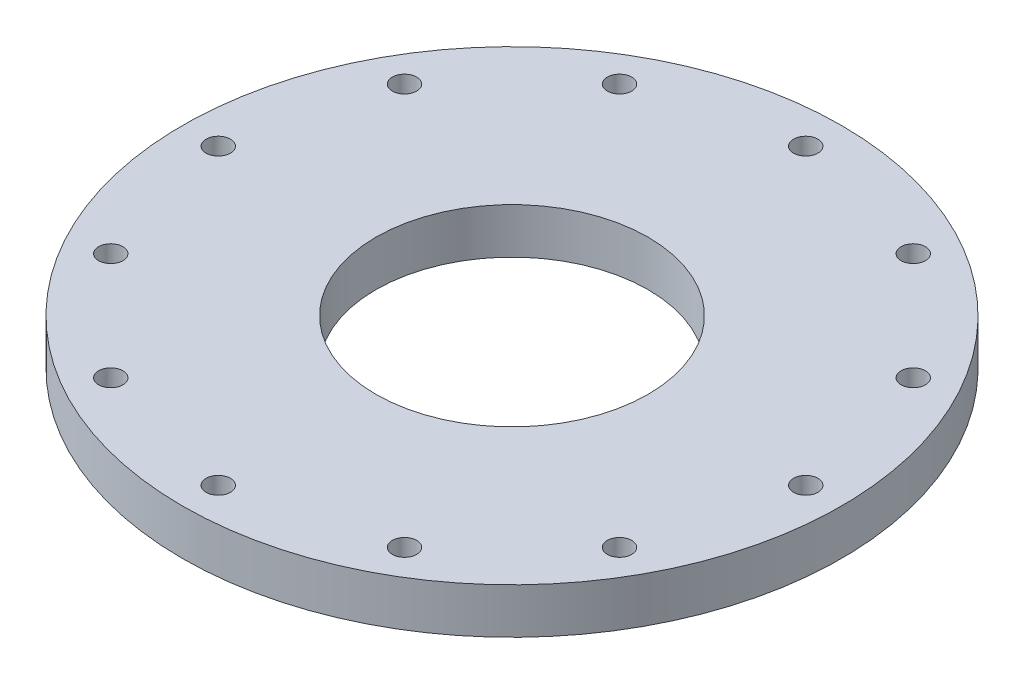
ISO-10303-21;
HEADER;
FILE_DESCRIPTION(('STEP AP214'),'2;1');
FILE_NAME('part.step','',(''),(''),'','','');
FILE_SCHEMA(('AUTOMOTIVE_DESIGN { 1 0 10303 214 1 1 1 1 }'));
ENDSEC;
DATA;
#1=APPLICATION_CONTEXT('core data for automotive mechanical design processes');
#2=APPLICATION_PROTOCOL_DEFINITION('international standard','automotive_design',2000,#1);
#3=PRODUCT_CONTEXT('',#1,'mechanical');
#4=PRODUCT('Part','Part','',(#3));
#5=PRODUCT_RELATED_PRODUCT_CATEGORY('part','',(#4));
#6=PRODUCT_DEFINITION_FORMATION('','',#4);
#7=PRODUCT_DEFINITION_CONTEXT('part definition',#1,'design');
#8=PRODUCT_DEFINITION('design','',#6,#7);
#9=PRODUCT_DEFINITION_SHAPE('','',#8);
#10=(LENGTH_UNIT() NAMED_UNIT(*) SI_UNIT(.MILLI.,.METRE.));
#11=(NAMED_UNIT(*) PLANE_ANGLE_UNIT() SI_UNIT($,.RADIAN.));
#12=(NAMED_UNIT(*) SI_UNIT($,.STERADIAN.) SOLID_ANGLE_UNIT());
#13=UNCERTAINTY_MEASURE_WITH_UNIT(LENGTH_MEASURE(1.E-05),#10,'distance_accuracy_value','');
#14=(GEOMETRIC_REPRESENTATION_CONTEXT(3) GLOBAL_UNCERTAINTY_ASSIGNED_CONTEXT((#13)) GLOBAL_UNIT_ASSIGNED_CONTEXT((#10,
#11,#12)) REPRESENTATION_CONTEXT('',''));
#15=CARTESIAN_POINT('',(0.,0.,0.));
#16=DIRECTION('',(0.,0.,1.));
#17=DIRECTION('',(1.,0.,0.));
#18=AXIS2_PLACEMENT_3D('',#15,#16,#17);
#19=CARTESIAN_POINT('',(0.,6.35,0.));
#20=DIRECTION('',(0.,-1.,0.));
#21=DIRECTION('',(0.,0.,-1.));
#22=AXIS2_PLACEMENT_3D('',#19,#20,#21);
#23=PLANE('',#22);
#24=CARTESIAN_POINT('',(-35.5070415551618,6.35,-20.5000000000004));
#25=DIRECTION('',(0.,1.,0.));
#26=DIRECTION('',(0.,0.,1.));
#27=AXIS2_PLACEMENT_3D('',#24,#25,#26);
#28=CIRCLE('',#27,1.69999999999999);
#29=CARTESIAN_POINT('',(-35.5070415551618,6.35,-18.8000000000004));
#30=VERTEX_POINT('',#29);
#31=EDGE_CURVE('E118',#30,#30,#28,.T.);
#32=ORIENTED_EDGE('',*,*,#31,.F.);
#33=EDGE_LOOP('',(#32));
#34=FACE_BOUND('',#33,.T.);
#35=CARTESIAN_POINT('',(41.,6.35,1.43150734892569E-13));
#36=DIRECTION('',(0.,1.,0.));
#37=DIRECTION('',(0.,0.,1.));
#38=AXIS2_PLACEMENT_3D('',#35,#36,#37);
#39=CIRCLE('',#38,1.69999999999999);
#40=CARTESIAN_POINT('',(41.,6.35,1.70000000000013));
#41=VERTEX_POINT('',#40);
#42=EDGE_CURVE('E76',#41,#41,#39,.T.);
#43=ORIENTED_EDGE('',*,*,#42,.F.);
#44=EDGE_LOOP('',(#43));
#45=FACE_BOUND('',#44,.T.);
#46=CARTESIAN_POINT('',(35.507041555162,6.35,-20.4999999999999));
#47=DIRECTION('',(0.,1.,0.));
#48=DIRECTION('',(0.,0.,1.));
#49=AXIS2_PLACEMENT_3D('',#46,#47,#48);
#50=CIRCLE('',#49,1.69999999999999);
#51=CARTESIAN_POINT('',(35.507041555162,6.35,-18.7999999999999));
#52=VERTEX_POINT('',#51);
#53=EDGE_CURVE('E70',#52,#52,#50,.T.);
#54=ORIENTED_EDGE('',*,*,#53,.F.);
#55=EDGE_LOOP('',(#54));
#56=FACE_BOUND('',#55,.T.);
#57=CARTESIAN_POINT('',(20.5,6.35,-35.507041555162));
#58=DIRECTION('',(0.,1.,0.));
#59=DIRECTION('',(0.,0.,1.));
#60=AXIS2_PLACEMENT_3D('',#57,#58,#59);
#61=CIRCLE('',#60,1.69999999999999);
#62=CARTESIAN_POINT('',(20.5,6.35,-33.807041555162));
#63=VERTEX_POINT('',#62);
#64=EDGE_CURVE('E64',#63,#63,#61,.T.);
#65=ORIENTED_EDGE('',*,*,#64,.F.);
#66=EDGE_LOOP('',(#65));
#67=FACE_BOUND('',#66,.T.);
#68=CARTESIAN_POINT('',(0.,6.35,-41.));
#69=DIRECTION('',(0.,1.,0.));
#70=DIRECTION('',(0.,0.,1.));
#71=AXIS2_PLACEMENT_3D('',#68,#69,#70);
#72=CIRCLE('',#71,1.69999999999999);
#73=CARTESIAN_POINT('',(0.,6.35,-39.3));
#74=VERTEX_POINT('',#73);
#75=EDGE_CURVE('E58',#74,#74,#72,.T.);
#76=ORIENTED_EDGE('',*,*,#75,.F.);
#77=EDGE_LOOP('',(#76));
#78=FACE_BOUND('',#77,.T.);
#79=CARTESIAN_POINT('',(0.,6.35,0.));
#80=DIRECTION('',(0.,-1.,0.));
#81=DIRECTION('',(0.,0.,-1.));
#82=AXIS2_PLACEMENT_3D('',#79,#80,#81);
#83=CIRCLE('',#82,46.);
#84=CARTESIAN_POINT('',(0.,6.35,-46.));
#85=VERTEX_POINT('',#84);
#86=EDGE_CURVE('E50',#85,#85,#83,.T.);
#87=ORIENTED_EDGE('',*,*,#86,.F.);
#88=EDGE_LOOP('',(#87));
#89=FACE_BOUND('',#88,.T.);
#90=CARTESIAN_POINT('',(0.,6.35,0.));
#91=DIRECTION('',(0.,-1.,0.));
#92=DIRECTION('',(0.,0.,-1.));
#93=AXIS2_PLACEMENT_3D('',#90,#91,#92);
#94=CIRCLE('',#93,19.);
#95=CARTESIAN_POINT('',(0.,6.35,-19.));
#96=VERTEX_POINT('',#95);
#97=EDGE_CURVE('E46',#96,#96,#94,.T.);
#98=ORIENTED_EDGE('',*,*,#97,.T.);
#99=EDGE_LOOP('',(#98));
#100=FACE_BOUND('',#99,.T.);
#101=CARTESIAN_POINT('',(35.5070415551619,6.35,20.5000000000002));
#102=DIRECTION('',(0.,1.,0.));
#103=DIRECTION('',(0.,0.,1.));
#104=AXIS2_PLACEMENT_3D('',#101,#102,#103);
#105=CIRCLE('',#104,1.69999999999999);
#106=CARTESIAN_POINT('',(35.5070415551619,6.35,22.2000000000002));
#107=VERTEX_POINT('',#106);
#108=EDGE_CURVE('E82',#107,#107,#105,.T.);
#109=ORIENTED_EDGE('',*,*,#108,.F.);
#110=EDGE_LOOP('',(#109));
#111=FACE_BOUND('',#110,.T.);
#112=CARTESIAN_POINT('',(20.4999999999998,6.35,35.5070415551621));
#113=DIRECTION('',(0.,1.,0.));
#114=DIRECTION('',(0.,0.,1.));
#115=AXIS2_PLACEMENT_3D('',#112,#113,#114);
#116=CIRCLE('',#115,1.69999999999999);
#117=CARTESIAN_POINT('',(20.4999999999998,6.35,37.2070415551621));
#118=VERTEX_POINT('',#117);
#119=EDGE_CURVE('E88',#118,#118,#116,.T.);
#120=ORIENTED_EDGE('',*,*,#119,.F.);
#121=EDGE_LOOP('',(#120));
#122=FACE_BOUND('',#121,.T.);
#123=CARTESIAN_POINT('',(0.,6.35,41.));
#124=DIRECTION('',(0.,1.,0.));
#125=DIRECTION('',(0.,0.,1.));
#126=AXIS2_PLACEMENT_3D('',#123,#124,#125);
#127=CIRCLE('',#126,1.69999999999999);
#128=CARTESIAN_POINT('',(0.,6.35,42.7));
#129=VERTEX_POINT('',#128);
#130=EDGE_CURVE('E94',#129,#129,#127,.T.);
#131=ORIENTED_EDGE('',*,*,#130,.F.);
#132=EDGE_LOOP('',(#131));
#133=FACE_BOUND('',#132,.T.);
#134=CARTESIAN_POINT('',(-20.5000000000003,6.35,35.5070415551618));
#135=DIRECTION('',(0.,1.,0.));
#136=DIRECTION('',(0.,0.,1.));
#137=AXIS2_PLACEMENT_3D('',#134,#135,#136);
#138=CIRCLE('',#137,1.69999999999999);
#139=CARTESIAN_POINT('',(-20.5000000000003,6.35,37.2070415551618));
#140=VERTEX_POINT('',#139);
#141=EDGE_CURVE('E100',#140,#140,#138,.T.);
#142=ORIENTED_EDGE('',*,*,#141,.F.);
#143=EDGE_LOOP('',(#142));
#144=FACE_BOUND('',#143,.T.);
#145=CARTESIAN_POINT('',(-35.5070415551622,6.35,20.4999999999997));
#146=DIRECTION('',(0.,1.,0.));
#147=DIRECTION('',(0.,0.,1.));
#148=AXIS2_PLACEMENT_3D('',#145,#146,#147);
#149=CIRCLE('',#148,1.69999999999999);
#150=CARTESIAN_POINT('',(-35.5070415551622,6.35,22.1999999999997));
#151=VERTEX_POINT('',#150);
#152=EDGE_CURVE('E106',#151,#151,#149,.T.);
#153=ORIENTED_EDGE('',*,*,#152,.F.);
#154=EDGE_LOOP('',(#153));
#155=FACE_BOUND('',#154,.T.);
#156=CARTESIAN_POINT('',(-41.,6.35,-4.29452204677706E-13));
#157=DIRECTION('',(0.,1.,0.));
#158=DIRECTION('',(0.,0.,1.));
#159=AXIS2_PLACEMENT_3D('',#156,#157,#158);
#160=CIRCLE('',#159,1.69999999999999);
#161=CARTESIAN_POINT('',(-41.,6.35,1.69999999999956));
#162=VERTEX_POINT('',#161);
#163=EDGE_CURVE('E112',#162,#162,#160,.T.);
#164=ORIENTED_EDGE('',*,*,#163,.F.);
#165=EDGE_LOOP('',(#164));
#166=FACE_BOUND('',#165,.T.);
#167=CARTESIAN_POINT('',(-20.4999999999995,6.35,-35.5070415551623));
#168=DIRECTION('',(0.,1.,0.));
#169=DIRECTION('',(0.,0.,1.));
#170=AXIS2_PLACEMENT_3D('',#167,#168,#169);
#171=CIRCLE('',#170,1.69999999999999);
#172=CARTESIAN_POINT('',(-20.4999999999995,6.35,-33.8070415551623));
#173=VERTEX_POINT('',#172);
#174=EDGE_CURVE('E124',#173,#173,#171,.T.);
#175=ORIENTED_EDGE('',*,*,#174,.F.);
#176=EDGE_LOOP('',(#175));
#177=FACE_BOUND('',#176,.T.);
#178=ADVANCED_FACE('F35',(#34,#45,#56,#67,#78,#89,#100,#111,#122,#133,#144,#155,#166,#177),#23,.F.);
#179=CARTESIAN_POINT('',(0.,0.,0.));
#180=DIRECTION('',(0.,-1.,0.));
#181=DIRECTION('',(0.,0.,-1.));
#182=AXIS2_PLACEMENT_3D('',#179,#180,#181);
#183=CYLINDRICAL_SURFACE('',#182,46.);
#184=CARTESIAN_POINT('',(0.,0.,0.));
#185=DIRECTION('',(0.,-1.,0.));
#186=DIRECTION('',(0.,0.,-1.));
#187=AXIS2_PLACEMENT_3D('',#184,#185,#186);
#188=CIRCLE('',#187,46.);
#189=CARTESIAN_POINT('',(0.,0.,-46.));
#190=VERTEX_POINT('',#189);
#191=EDGE_CURVE('E10',#190,#190,#188,.T.);
#192=ORIENTED_EDGE('',*,*,#191,.F.);
#193=EDGE_LOOP('',(#192));
#194=FACE_BOUND('',#193,.T.);
#195=ORIENTED_EDGE('',*,*,#86,.T.);
#196=EDGE_LOOP('',(#195));
#197=FACE_BOUND('',#196,.T.);
#198=ADVANCED_FACE('F37',(#194,#197),#183,.T.);
#199=CARTESIAN_POINT('',(0.,0.,0.));
#200=DIRECTION('',(0.,1.,0.));
#201=DIRECTION('',(0.,0.,1.));
#202=AXIS2_PLACEMENT_3D('',#199,#200,#201);
#203=PLANE('',#202);
#204=CARTESIAN_POINT('',(-20.4999999999995,0.,-35.5070415551623));
#205=DIRECTION('',(0.,1.,0.));
#206=DIRECTION('',(0.,0.,1.));
#207=AXIS2_PLACEMENT_3D('',#204,#205,#206);
#208=CIRCLE('',#207,1.7);
#209=CARTESIAN_POINT('',(-20.4999999999995,0.,-33.8070415551623));
#210=VERTEX_POINT('',#209);
#211=EDGE_CURVE('E121',#210,#210,#208,.T.);
#212=ORIENTED_EDGE('',*,*,#211,.T.);
#213=EDGE_LOOP('',(#212));
#214=FACE_BOUND('',#213,.T.);
#215=CARTESIAN_POINT('',(-35.5070415551618,0.,-20.5000000000004));
#216=DIRECTION('',(0.,1.,0.));
#217=DIRECTION('',(0.,0.,1.));
#218=AXIS2_PLACEMENT_3D('',#215,#216,#217);
#219=CIRCLE('',#218,1.7);
#220=CARTESIAN_POINT('',(-35.5070415551618,0.,-18.8000000000004));
#221=VERTEX_POINT('',#220);
#222=EDGE_CURVE('E115',#221,#221,#219,.T.);
#223=ORIENTED_EDGE('',*,*,#222,.T.);
#224=EDGE_LOOP('',(#223));
#225=FACE_BOUND('',#224,.T.);
#226=CARTESIAN_POINT('',(-41.,0.,-4.29452204677706E-13));
#227=DIRECTION('',(0.,1.,0.));
#228=DIRECTION('',(0.,0.,1.));
#229=AXIS2_PLACEMENT_3D('',#226,#227,#228);
#230=CIRCLE('',#229,1.7);
#231=CARTESIAN_POINT('',(-41.,0.,1.69999999999957));
#232=VERTEX_POINT('',#231);
#233=EDGE_CURVE('E109',#232,#232,#230,.T.);
#234=ORIENTED_EDGE('',*,*,#233,.T.);
#235=EDGE_LOOP('',(#234));
#236=FACE_BOUND('',#235,.T.);
#237=CARTESIAN_POINT('',(-35.5070415551622,0.,20.4999999999997));
#238=DIRECTION('',(0.,1.,0.));
#239=DIRECTION('',(0.,0.,1.));
#240=AXIS2_PLACEMENT_3D('',#237,#238,#239);
#241=CIRCLE('',#240,1.7);
#242=CARTESIAN_POINT('',(-35.5070415551622,0.,22.1999999999997));
#243=VERTEX_POINT('',#242);
#244=EDGE_CURVE('E103',#243,#243,#241,.T.);
#245=ORIENTED_EDGE('',*,*,#244,.T.);
#246=EDGE_LOOP('',(#245));
#247=FACE_BOUND('',#246,.T.);
#248=CARTESIAN_POINT('',(-20.5000000000003,0.,35.5070415551618));
#249=DIRECTION('',(0.,1.,0.));
#250=DIRECTION('',(0.,0.,1.));
#251=AXIS2_PLACEMENT_3D('',#248,#249,#250);
#252=CIRCLE('',#251,1.7);
#253=CARTESIAN_POINT('',(-20.5000000000003,0.,37.2070415551618));
#254=VERTEX_POINT('',#253);
#255=EDGE_CURVE('E97',#254,#254,#252,.T.);
#256=ORIENTED_EDGE('',*,*,#255,.T.);
#257=EDGE_LOOP('',(#256));
#258=FACE_BOUND('',#257,.T.);
#259=CARTESIAN_POINT('',(0.,0.,41.));
#260=DIRECTION('',(0.,1.,0.));
#261=DIRECTION('',(0.,0.,1.));
#262=AXIS2_PLACEMENT_3D('',#259,#260,#261);
#263=CIRCLE('',#262,1.7);
#264=CARTESIAN_POINT('',(0.,0.,42.7));
#265=VERTEX_POINT('',#264);
#266=EDGE_CURVE('E91',#265,#265,#263,.T.);
#267=ORIENTED_EDGE('',*,*,#266,.T.);
#268=EDGE_LOOP('',(#267));
#269=FACE_BOUND('',#268,.T.);
#270=CARTESIAN_POINT('',(20.4999999999998,0.,35.5070415551621));
#271=DIRECTION('',(0.,1.,0.));
#272=DIRECTION('',(0.,0.,1.));
#273=AXIS2_PLACEMENT_3D('',#270,#271,#272);
#274=CIRCLE('',#273,1.7);
#275=CARTESIAN_POINT('',(20.4999999999998,0.,37.2070415551621));
#276=VERTEX_POINT('',#275);
#277=EDGE_CURVE('E85',#276,#276,#274,.T.);
#278=ORIENTED_EDGE('',*,*,#277,.T.);
#279=EDGE_LOOP('',(#278));
#280=FACE_BOUND('',#279,.T.);
#281=CARTESIAN_POINT('',(35.5070415551619,0.,20.5000000000002));
#282=DIRECTION('',(0.,1.,0.));
#283=DIRECTION('',(0.,0.,1.));
#284=AXIS2_PLACEMENT_3D('',#281,#282,#283);
#285=CIRCLE('',#284,1.7);
#286=CARTESIAN_POINT('',(35.5070415551619,0.,22.2000000000002));
#287=VERTEX_POINT('',#286);
#288=EDGE_CURVE('E79',#287,#287,#285,.T.);
#289=ORIENTED_EDGE('',*,*,#288,.T.);
#290=EDGE_LOOP('',(#289));
#291=FACE_BOUND('',#290,.T.);
#292=CARTESIAN_POINT('',(41.,0.,1.43150734892569E-13));
#293=DIRECTION('',(0.,1.,0.));
#294=DIRECTION('',(0.,0.,1.));
#295=AXIS2_PLACEMENT_3D('',#292,#293,#294);
#296=CIRCLE('',#295,1.7);
#297=CARTESIAN_POINT('',(41.,0.,1.70000000000014));
#298=VERTEX_POINT('',#297);
#299=EDGE_CURVE('E73',#298,#298,#296,.T.);
#300=ORIENTED_EDGE('',*,*,#299,.T.);
#301=EDGE_LOOP('',(#300));
#302=FACE_BOUND('',#301,.T.);
#303=CARTESIAN_POINT('',(35.507041555162,0.,-20.4999999999999));
#304=DIRECTION('',(0.,1.,0.));
#305=DIRECTION('',(0.,0.,1.));
#306=AXIS2_PLACEMENT_3D('',#303,#304,#305);
#307=CIRCLE('',#306,1.7);
#308=CARTESIAN_POINT('',(35.507041555162,0.,-18.7999999999999));
#309=VERTEX_POINT('',#308);
#310=EDGE_CURVE('E67',#309,#309,#307,.T.);
#311=ORIENTED_EDGE('',*,*,#310,.T.);
#312=EDGE_LOOP('',(#311));
#313=FACE_BOUND('',#312,.T.);
#314=CARTESIAN_POINT('',(20.5,0.,-35.507041555162));
#315=DIRECTION('',(0.,1.,0.));
#316=DIRECTION('',(0.,0.,1.));
#317=AXIS2_PLACEMENT_3D('',#314,#315,#316);
#318=CIRCLE('',#317,1.7);
#319=CARTESIAN_POINT('',(20.5,0.,-33.807041555162));
#320=VERTEX_POINT('',#319);
#321=EDGE_CURVE('E61',#320,#320,#318,.T.);
#322=ORIENTED_EDGE('',*,*,#321,.T.);
#323=EDGE_LOOP('',(#322));
#324=FACE_BOUND('',#323,.T.);
#325=CARTESIAN_POINT('',(0.,0.,-41.));
#326=DIRECTION('',(0.,1.,0.));
#327=DIRECTION('',(0.,0.,1.));
#328=AXIS2_PLACEMENT_3D('',#325,#326,#327);
#329=CIRCLE('',#328,1.7);
#330=CARTESIAN_POINT('',(0.,0.,-39.3));
#331=VERTEX_POINT('',#330);
#332=EDGE_CURVE('E55',#331,#331,#329,.T.);
#333=ORIENTED_EDGE('',*,*,#332,.T.);
#334=EDGE_LOOP('',(#333));
#335=FACE_BOUND('',#334,.T.);
#336=CARTESIAN_POINT('',(0.,0.,0.));
#337=DIRECTION('',(0.,-1.,0.));
#338=DIRECTION('',(0.,0.,-1.));
#339=AXIS2_PLACEMENT_3D('',#336,#337,#338);
#340=CIRCLE('',#339,19.);
#341=CARTESIAN_POINT('',(0.,0.,-19.));
#342=VERTEX_POINT('',#341);
#343=EDGE_CURVE('E42',#342,#342,#340,.T.);
#344=ORIENTED_EDGE('',*,*,#343,.F.);
#345=EDGE_LOOP('',(#344));
#346=FACE_BOUND('',#345,.T.);
#347=ORIENTED_EDGE('',*,*,#191,.T.);
#348=EDGE_LOOP('',(#347));
#349=FACE_BOUND('',#348,.T.);
#350=ADVANCED_FACE('F136',(#214,#225,#236,#247,#258,#269,#280,#291,#302,#313,#324,#335,#346,
#349),#203,.F.);
#351=CARTESIAN_POINT('',(0.,0.,0.));
#352=DIRECTION('',(0.,-1.,0.));
#353=DIRECTION('',(0.,0.,-1.));
#354=AXIS2_PLACEMENT_3D('',#351,#352,#353);
#355=CYLINDRICAL_SURFACE('',#354,19.);
#356=ORIENTED_EDGE('',*,*,#97,.F.);
#357=EDGE_LOOP('',(#356));
#358=FACE_BOUND('',#357,.T.);
#359=ORIENTED_EDGE('',*,*,#343,.T.);
#360=EDGE_LOOP('',(#359));
#361=FACE_BOUND('',#360,.T.);
#362=ADVANCED_FACE('F144',(#358,#361),#355,.F.);
#363=CARTESIAN_POINT('',(0.,6.35,-41.));
#364=DIRECTION('',(0.,1.,0.));
#365=DIRECTION('',(0.,0.,1.));
#366=AXIS2_PLACEMENT_3D('',#363,#364,#365);
#367=CYLINDRICAL_SURFACE('',#366,1.69999999999999);
#368=ORIENTED_EDGE('',*,*,#332,.F.);
#369=EDGE_LOOP('',(#368));
#370=FACE_BOUND('',#369,.T.);
#371=ORIENTED_EDGE('',*,*,#75,.T.);
#372=EDGE_LOOP('',(#371));
#373=FACE_BOUND('',#372,.T.);
#374=ADVANCED_FACE('F142',(#370,#373),#367,.F.);
#375=CARTESIAN_POINT('',(20.5,6.35,-35.507041555162));
#376=DIRECTION('',(0.,1.,0.));
#377=DIRECTION('',(0.,0.,1.));
#378=AXIS2_PLACEMENT_3D('',#375,#376,#377);
#379=CYLINDRICAL_SURFACE('',#378,1.69999999999999);
#380=ORIENTED_EDGE('',*,*,#321,.F.);
#381=EDGE_LOOP('',(#380));
#382=FACE_BOUND('',#381,.T.);
#383=ORIENTED_EDGE('',*,*,#64,.T.);
#384=EDGE_LOOP('',(#383));
#385=FACE_BOUND('',#384,.T.);
#386=ADVANCED_FACE('F178',(#382,#385),#379,.F.);
#387=CARTESIAN_POINT('',(35.507041555162,6.35,-20.4999999999999));
#388=DIRECTION('',(0.,1.,0.));
#389=DIRECTION('',(0.,0.,1.));
#390=AXIS2_PLACEMENT_3D('',#387,#388,#389);
#391=CYLINDRICAL_SURFACE('',#390,1.69999999999999);
#392=ORIENTED_EDGE('',*,*,#310,.F.);
#393=EDGE_LOOP('',(#392));
#394=FACE_BOUND('',#393,.T.);
#395=ORIENTED_EDGE('',*,*,#53,.T.);
#396=EDGE_LOOP('',(#395));
#397=FACE_BOUND('',#396,.T.);
#398=ADVANCED_FACE('F233',(#394,#397),#391,.F.);
#399=CARTESIAN_POINT('',(41.,6.35,1.43150734892569E-13));
#400=DIRECTION('',(0.,1.,0.));
#401=DIRECTION('',(0.,0.,1.));
#402=AXIS2_PLACEMENT_3D('',#399,#400,#401);
#403=CYLINDRICAL_SURFACE('',#402,1.69999999999999);
#404=ORIENTED_EDGE('',*,*,#299,.F.);
#405=EDGE_LOOP('',(#404));
#406=FACE_BOUND('',#405,.T.);
#407=ORIENTED_EDGE('',*,*,#42,.T.);
#408=EDGE_LOOP('',(#407));
#409=FACE_BOUND('',#408,.T.);
#410=ADVANCED_FACE('F229',(#406,#409),#403,.F.);
#411=CARTESIAN_POINT('',(35.5070415551619,6.35,20.5000000000002));
#412=DIRECTION('',(0.,1.,0.));
#413=DIRECTION('',(0.,0.,1.));
#414=AXIS2_PLACEMENT_3D('',#411,#412,#413);
#415=CYLINDRICAL_SURFACE('',#414,1.69999999999999);
#416=ORIENTED_EDGE('',*,*,#288,.F.);
#417=EDGE_LOOP('',(#416));
#418=FACE_BOUND('',#417,.T.);
#419=ORIENTED_EDGE('',*,*,#108,.T.);
#420=EDGE_LOOP('',(#419));
#421=FACE_BOUND('',#420,.T.);
#422=ADVANCED_FACE('F225',(#418,#421),#415,.F.);
#423=CARTESIAN_POINT('',(20.4999999999998,6.35,35.5070415551621));
#424=DIRECTION('',(0.,1.,0.));
#425=DIRECTION('',(0.,0.,1.));
#426=AXIS2_PLACEMENT_3D('',#423,#424,#425);
#427=CYLINDRICAL_SURFACE('',#426,1.69999999999999);
#428=ORIENTED_EDGE('',*,*,#277,.F.);
#429=EDGE_LOOP('',(#428));
#430=FACE_BOUND('',#429,.T.);
#431=ORIENTED_EDGE('',*,*,#119,.T.);
#432=EDGE_LOOP('',(#431));
#433=FACE_BOUND('',#432,.T.);
#434=ADVANCED_FACE('F221',(#430,#433),#427,.F.);
#435=CARTESIAN_POINT('',(0.,6.35,41.));
#436=DIRECTION('',(0.,1.,0.));
#437=DIRECTION('',(0.,0.,1.));
#438=AXIS2_PLACEMENT_3D('',#435,#436,#437);
#439=CYLINDRICAL_SURFACE('',#438,1.69999999999999);
#440=ORIENTED_EDGE('',*,*,#266,.F.);
#441=EDGE_LOOP('',(#440));
#442=FACE_BOUND('',#441,.T.);
#443=ORIENTED_EDGE('',*,*,#130,.T.);
#444=EDGE_LOOP('',(#443));
#445=FACE_BOUND('',#444,.T.);
#446=ADVANCED_FACE('F217',(#442,#445),#439,.F.);
#447=CARTESIAN_POINT('',(-20.5000000000003,6.35,35.5070415551618));
#448=DIRECTION('',(0.,1.,0.));
#449=DIRECTION('',(0.,0.,1.));
#450=AXIS2_PLACEMENT_3D('',#447,#448,#449);
#451=CYLINDRICAL_SURFACE('',#450,1.69999999999999);
#452=ORIENTED_EDGE('',*,*,#255,.F.);
#453=EDGE_LOOP('',(#452));
#454=FACE_BOUND('',#453,.T.);
#455=ORIENTED_EDGE('',*,*,#141,.T.);
#456=EDGE_LOOP('',(#455));
#457=FACE_BOUND('',#456,.T.);
#458=ADVANCED_FACE('F210',(#454,#457),#451,.F.);
#459=CARTESIAN_POINT('',(-35.5070415551622,6.35,20.4999999999997));
#460=DIRECTION('',(0.,1.,0.));
#461=DIRECTION('',(0.,0.,1.));
#462=AXIS2_PLACEMENT_3D('',#459,#460,#461);
#463=CYLINDRICAL_SURFACE('',#462,1.69999999999999);
#464=ORIENTED_EDGE('',*,*,#244,.F.);
#465=EDGE_LOOP('',(#464));
#466=FACE_BOUND('',#465,.T.);
#467=ORIENTED_EDGE('',*,*,#152,.T.);
#468=EDGE_LOOP('',(#467));
#469=FACE_BOUND('',#468,.T.);
#470=ADVANCED_FACE('F201',(#466,#469),#463,.F.);
#471=CARTESIAN_POINT('',(-41.,6.35,-4.29452204677706E-13));
#472=DIRECTION('',(0.,1.,0.));
#473=DIRECTION('',(0.,0.,1.));
#474=AXIS2_PLACEMENT_3D('',#471,#472,#473);
#475=CYLINDRICAL_SURFACE('',#474,1.69999999999999);
#476=ORIENTED_EDGE('',*,*,#233,.F.);
#477=EDGE_LOOP('',(#476));
#478=FACE_BOUND('',#477,.T.);
#479=ORIENTED_EDGE('',*,*,#163,.T.);
#480=EDGE_LOOP('',(#479));
#481=FACE_BOUND('',#480,.T.);
#482=ADVANCED_FACE('F198',(#478,#481),#475,.F.);
#483=CARTESIAN_POINT('',(-35.5070415551618,6.35,-20.5000000000004));
#484=DIRECTION('',(0.,1.,0.));
#485=DIRECTION('',(0.,0.,1.));
#486=AXIS2_PLACEMENT_3D('',#483,#484,#485);
#487=CYLINDRICAL_SURFACE('',#486,1.69999999999999);
#488=ORIENTED_EDGE('',*,*,#222,.F.);
#489=EDGE_LOOP('',(#488));
#490=FACE_BOUND('',#489,.T.);
#491=ORIENTED_EDGE('',*,*,#31,.T.);
#492=EDGE_LOOP('',(#491));
#493=FACE_BOUND('',#492,.T.);
#494=ADVANCED_FACE('F200',(#490,#493),#487,.F.);
#495=CARTESIAN_POINT('',(-20.4999999999995,6.35,-35.5070415551623));
#496=DIRECTION('',(0.,1.,0.));
#497=DIRECTION('',(0.,0.,1.));
#498=AXIS2_PLACEMENT_3D('',#495,#496,#497);
#499=CYLINDRICAL_SURFACE('',#498,1.69999999999999);
#500=ORIENTED_EDGE('',*,*,#211,.F.);
#501=EDGE_LOOP('',(#500));
#502=FACE_BOUND('',#501,.T.);
#503=ORIENTED_EDGE('',*,*,#174,.T.);
#504=EDGE_LOOP('',(#503));
#505=FACE_BOUND('',#504,.T.);
#506=ADVANCED_FACE('F128',(#502,#505),#499,.F.);
#507=CLOSED_SHELL('',(#178,#198,#350,#362,#374,#386,#398,#410,#422,#434,#446,#458,#470,#482,
#494,#506));
#508=MANIFOLD_SOLID_BREP('B2',#507);
#509=ADVANCED_BREP_SHAPE_REPRESENTATION('',(#18,#508),#14);
#510=SHAPE_DEFINITION_REPRESENTATION(#9,#509);
ENDSEC;
END-ISO-10303-21;
